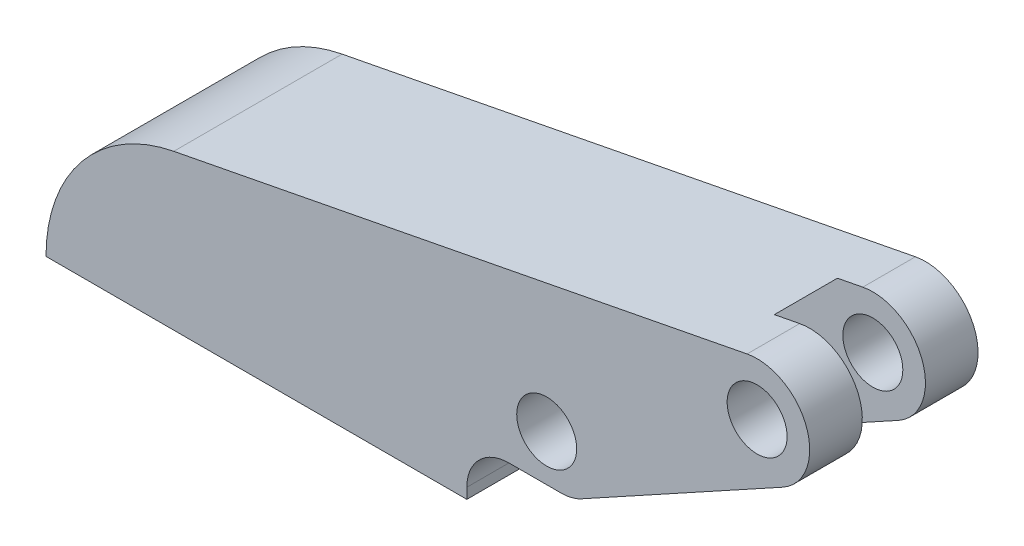
ISO-10303-21;
HEADER;
FILE_DESCRIPTION(('STEP AP214'),'2;1');
FILE_NAME('part.step','',(''),(''),'','','');
FILE_SCHEMA(('AUTOMOTIVE_DESIGN { 1 0 10303 214 1 1 1 1 }'));
ENDSEC;
DATA;
#1=APPLICATION_CONTEXT('core data for automotive mechanical design processes');
#2=APPLICATION_PROTOCOL_DEFINITION('international standard','automotive_design',2000,#1);
#3=PRODUCT_CONTEXT('',#1,'mechanical');
#4=PRODUCT('Part','Part','',(#3));
#5=PRODUCT_RELATED_PRODUCT_CATEGORY('part','',(#4));
#6=PRODUCT_DEFINITION_FORMATION('','',#4);
#7=PRODUCT_DEFINITION_CONTEXT('part definition',#1,'design');
#8=PRODUCT_DEFINITION('design','',#6,#7);
#9=PRODUCT_DEFINITION_SHAPE('','',#8);
#10=(LENGTH_UNIT() NAMED_UNIT(*) SI_UNIT(.MILLI.,.METRE.));
#11=(NAMED_UNIT(*) PLANE_ANGLE_UNIT() SI_UNIT($,.RADIAN.));
#12=(NAMED_UNIT(*) SI_UNIT($,.STERADIAN.) SOLID_ANGLE_UNIT());
#13=UNCERTAINTY_MEASURE_WITH_UNIT(LENGTH_MEASURE(1.E-05),#10,'distance_accuracy_value','');
#14=(GEOMETRIC_REPRESENTATION_CONTEXT(3) GLOBAL_UNCERTAINTY_ASSIGNED_CONTEXT((#13)) GLOBAL_UNIT_ASSIGNED_CONTEXT((#10,
#11,#12)) REPRESENTATION_CONTEXT('',''));
#15=CARTESIAN_POINT('',(0.,0.,0.));
#16=DIRECTION('',(0.,0.,1.));
#17=DIRECTION('',(1.,0.,0.));
#18=AXIS2_PLACEMENT_3D('',#15,#16,#17);
#19=CARTESIAN_POINT('',(45.8343180392922,14.7059179973023,16.));
#20=DIRECTION('',(-0.481918749772156,0.876215908676647,0.));
#21=DIRECTION('',(-0.876215908676647,-0.481918749772156,0.));
#22=AXIS2_PLACEMENT_3D('',#19,#20,#21);
#23=PLANE('',#22);
#24=DIRECTION('',(0.876215908676647,0.481918749772156,0.));
#25=VECTOR('',#24,1.);
#26=CARTESIAN_POINT('',(45.8343180392922,14.7059179973023,4.99999999999999));
#27=LINE('',#26,#25);
#28=CARTESIAN_POINT('',(42.5904062511392,12.9217665138182,5.));
#29=VERTEX_POINT('',#28);
#30=CARTESIAN_POINT('',(64.227719619958,24.8222888666685,4.99999999999999));
#31=VERTEX_POINT('',#30);
#32=EDGE_CURVE('E172',#29,#31,#27,.T.);
#33=ORIENTED_EDGE('',*,*,#32,.T.);
#34=DIRECTION('',(0.,0.,1.));
#35=VECTOR('',#34,1.);
#36=CARTESIAN_POINT('',(64.227719619958,24.8222888666685,16.));
#37=LINE('',#36,#35);
#38=CARTESIAN_POINT('',(64.2277196199582,24.8222888666686,11.));
#39=VERTEX_POINT('',#38);
#40=EDGE_CURVE('E14',#31,#39,#37,.T.);
#41=ORIENTED_EDGE('',*,*,#40,.T.);
#42=DIRECTION('',(0.876215908676647,0.481918749772156,0.));
#43=VECTOR('',#42,1.);
#44=CARTESIAN_POINT('',(86.6879313200957,37.1754053017442,11.));
#45=LINE('',#44,#43);
#46=CARTESIAN_POINT('',(42.5904062511392,12.9217665138182,11.));
#47=VERTEX_POINT('',#46);
#48=EDGE_CURVE('E390',#47,#39,#45,.T.);
#49=ORIENTED_EDGE('',*,*,#48,.F.);
#50=DIRECTION('',(0.,0.,1.));
#51=VECTOR('',#50,1.);
#52=CARTESIAN_POINT('',(42.5904062511392,12.9217665138182,11.));
#53=LINE('',#52,#51);
#54=EDGE_CURVE('E206',#29,#47,#53,.T.);
#55=ORIENTED_EDGE('',*,*,#54,.F.);
#56=EDGE_LOOP('',(#33,#41,#49,#55));
#57=FACE_BOUND('',#56,.T.);
#58=ADVANCED_FACE('F50',(#57),#23,.F.);
#59=CARTESIAN_POINT('',(72.5904062511392,62.8072690634833,11.));
#60=DIRECTION('',(0.,0.,-1.));
#61=DIRECTION('',(-1.,0.,0.));
#62=AXIS2_PLACEMENT_3D('',#59,#60,#61);
#63=PLANE('',#62);
#64=CARTESIAN_POINT('',(47.5904062511392,9.38107954338324,11.));
#65=DIRECTION('',(0.,0.,-1.));
#66=DIRECTION('',(-1.,0.,0.));
#67=AXIS2_PLACEMENT_3D('',#64,#65,#66);
#68=CIRCLE('',#67,2.85);
#69=CARTESIAN_POINT('',(44.7404062511392,9.38107954338324,11.));
#70=VERTEX_POINT('',#69);
#71=EDGE_CURVE('E384',#70,#70,#68,.T.);
#72=ORIENTED_EDGE('',*,*,#71,.F.);
#73=EDGE_LOOP('',(#72));
#74=FACE_BOUND('',#73,.T.);
#75=CARTESIAN_POINT('',(67.5904062511392,20.3810795433832,11.));
#76=DIRECTION('',(0.,0.,-1.));
#77=DIRECTION('',(-1.,0.,0.));
#78=AXIS2_PLACEMENT_3D('',#75,#76,#77);
#79=CIRCLE('',#78,2.85);
#80=CARTESIAN_POINT('',(64.7404062511392,20.3810795433832,11.));
#81=VERTEX_POINT('',#80);
#82=EDGE_CURVE('E205',#81,#81,#79,.T.);
#83=ORIENTED_EDGE('',*,*,#82,.F.);
#84=EDGE_LOOP('',(#83));
#85=FACE_BOUND('',#84,.T.);
#86=DIRECTION('',(-0.981723650130097,-0.190312045796475,0.));
#87=VECTOR('',#86,1.);
#88=CARTESIAN_POINT('',(12.1453193130529,14.7258547519514,11.));
#89=LINE('',#88,#87);
#90=CARTESIAN_POINT('',(66.6388460221569,25.2896977940337,11.));
#91=VERTEX_POINT('',#90);
#92=EDGE_CURVE('E57',#91,#39,#89,.T.);
#93=ORIENTED_EDGE('',*,*,#92,.F.);
#94=CARTESIAN_POINT('',(67.5904062511392,20.3810795433832,11.));
#95=DIRECTION('',(0.,0.,-1.));
#96=DIRECTION('',(-1.,0.,0.));
#97=AXIS2_PLACEMENT_3D('',#94,#95,#96);
#98=CIRCLE('',#97,5.);
#99=CARTESIAN_POINT('',(70.,16.,11.));
#100=VERTEX_POINT('',#99);
#101=EDGE_CURVE('E383',#100,#91,#98,.F.);
#102=ORIENTED_EDGE('',*,*,#101,.F.);
#103=DIRECTION('',(-0.876215908676647,-0.481918749772156,0.));
#104=VECTOR('',#103,1.);
#105=CARTESIAN_POINT('',(50.9002479368971,5.49513636529341,11.));
#106=LINE('',#105,#104);
#107=CARTESIAN_POINT('',(50.9002479368971,5.49513636529341,11.));
#108=VERTEX_POINT('',#107);
#109=EDGE_CURVE('E380',#100,#108,#106,.T.);
#110=ORIENTED_EDGE('',*,*,#109,.T.);
#111=CARTESIAN_POINT('',(48.9725729378085,9.,11.));
#112=DIRECTION('',(0.,0.,-1.));
#113=DIRECTION('',(-1.,0.,0.));
#114=AXIS2_PLACEMENT_3D('',#111,#112,#113);
#115=CIRCLE('',#114,4.);
#116=CARTESIAN_POINT('',(48.9725729378085,5.,11.));
#117=VERTEX_POINT('',#116);
#118=EDGE_CURVE('E375',#117,#108,#115,.F.);
#119=ORIENTED_EDGE('',*,*,#118,.F.);
#120=DIRECTION('',(-1.,0.,0.));
#121=VECTOR('',#120,1.);
#122=CARTESIAN_POINT('',(44.,5.,11.));
#123=LINE('',#122,#121);
#124=CARTESIAN_POINT('',(44.,5.,11.));
#125=VERTEX_POINT('',#124);
#126=EDGE_CURVE('E368',#117,#125,#123,.T.);
#127=ORIENTED_EDGE('',*,*,#126,.T.);
#128=CARTESIAN_POINT('',(44.,1.,11.));
#129=DIRECTION('',(0.,0.,-1.));
#130=DIRECTION('',(-1.,0.,0.));
#131=AXIS2_PLACEMENT_3D('',#128,#129,#130);
#132=CIRCLE('',#131,4.);
#133=CARTESIAN_POINT('',(42.5904062511392,4.74340025420374,11.));
#134=VERTEX_POINT('',#133);
#135=EDGE_CURVE('E314',#125,#134,#132,.F.);
#136=ORIENTED_EDGE('',*,*,#135,.T.);
#137=DIRECTION('',(0.,-1.,0.));
#138=VECTOR('',#137,1.);
#139=CARTESIAN_POINT('',(42.5904062511392,62.8072690634833,11.));
#140=LINE('',#139,#138);
#141=EDGE_CURVE('E189',#47,#134,#140,.T.);
#142=ORIENTED_EDGE('',*,*,#141,.F.);
#143=ORIENTED_EDGE('',*,*,#48,.T.);
#144=EDGE_LOOP('',(#93,#102,#110,#119,#127,#136,#142,#143));
#145=FACE_BOUND('',#144,.T.);
#146=ADVANCED_FACE('F456',(#74,#85,#145),#63,.T.);
#147=CARTESIAN_POINT('',(44.,1.,4.99999999999999));
#148=DIRECTION('',(0.,0.,1.));
#149=DIRECTION('',(1.,0.,0.));
#150=AXIS2_PLACEMENT_3D('',#147,#148,#149);
#151=PLANE('',#150);
#152=CARTESIAN_POINT('',(67.5904062511392,20.3810795433832,4.99999999999999));
#153=DIRECTION('',(0.,0.,-1.));
#154=DIRECTION('',(1.,0.,0.));
#155=AXIS2_PLACEMENT_3D('',#152,#153,#154);
#156=CIRCLE('',#155,2.85000000000001);
#157=CARTESIAN_POINT('',(70.4404062511392,20.3810795433832,4.99999999999999));
#158=VERTEX_POINT('',#157);
#159=EDGE_CURVE('E419',#158,#158,#156,.T.);
#160=ORIENTED_EDGE('',*,*,#159,.T.);
#161=EDGE_LOOP('',(#160));
#162=FACE_BOUND('',#161,.T.);
#163=CARTESIAN_POINT('',(47.5904062511392,9.38107954338324,4.99999999999999));
#164=DIRECTION('',(0.,0.,-1.));
#165=DIRECTION('',(1.,0.,0.));
#166=AXIS2_PLACEMENT_3D('',#163,#164,#165);
#167=CIRCLE('',#166,2.85);
#168=CARTESIAN_POINT('',(50.4404062511392,9.38107954338324,4.99999999999999));
#169=VERTEX_POINT('',#168);
#170=EDGE_CURVE('E407',#169,#169,#167,.T.);
#171=ORIENTED_EDGE('',*,*,#170,.T.);
#172=EDGE_LOOP('',(#171));
#173=FACE_BOUND('',#172,.T.);
#174=CARTESIAN_POINT('',(67.5904062511392,20.3810795433832,4.99999999999999));
#175=DIRECTION('',(0.,0.,-1.));
#176=DIRECTION('',(-1.,0.,0.));
#177=AXIS2_PLACEMENT_3D('',#174,#175,#176);
#178=CIRCLE('',#177,5.);
#179=CARTESIAN_POINT('',(66.6388460221569,25.2896977940337,4.99999999999999));
#180=VERTEX_POINT('',#179);
#181=CARTESIAN_POINT('',(70.,16.,4.99999999999999));
#182=VERTEX_POINT('',#181);
#183=EDGE_CURVE('E414',#180,#182,#178,.T.);
#184=ORIENTED_EDGE('',*,*,#183,.F.);
#185=DIRECTION('',(-0.981723650130097,-0.190312045796475,0.));
#186=VECTOR('',#185,1.);
#187=CARTESIAN_POINT('',(40.281811580834,20.1802546783549,4.99999999999999));
#188=LINE('',#187,#186);
#189=EDGE_CURVE('E191',#180,#31,#188,.T.);
#190=ORIENTED_EDGE('',*,*,#189,.T.);
#191=ORIENTED_EDGE('',*,*,#32,.F.);
#192=DIRECTION('',(0.,1.,0.));
#193=VECTOR('',#192,1.);
#194=CARTESIAN_POINT('',(42.5904062511392,4.74340025420374,5.));
#195=LINE('',#194,#193);
#196=CARTESIAN_POINT('',(42.5904062511392,4.74340025420374,5.));
#197=VERTEX_POINT('',#196);
#198=EDGE_CURVE('E165',#197,#29,#195,.T.);
#199=ORIENTED_EDGE('',*,*,#198,.F.);
#200=CARTESIAN_POINT('',(44.,1.,4.99999999999999));
#201=DIRECTION('',(0.,0.,1.));
#202=DIRECTION('',(1.,0.,0.));
#203=AXIS2_PLACEMENT_3D('',#200,#201,#202);
#204=CIRCLE('',#203,3.99999999999999);
#205=CARTESIAN_POINT('',(44.,5.,5.));
#206=VERTEX_POINT('',#205);
#207=EDGE_CURVE('E169',#206,#197,#204,.T.);
#208=ORIENTED_EDGE('',*,*,#207,.F.);
#209=DIRECTION('',(-1.,0.,0.));
#210=VECTOR('',#209,1.);
#211=CARTESIAN_POINT('',(48.9725729378085,5.,4.99999999999999));
#212=LINE('',#211,#210);
#213=CARTESIAN_POINT('',(48.9725729378085,5.,4.99999999999999));
#214=VERTEX_POINT('',#213);
#215=EDGE_CURVE('E395',#214,#206,#212,.T.);
#216=ORIENTED_EDGE('',*,*,#215,.F.);
#217=CARTESIAN_POINT('',(48.9725729378085,9.,4.99999999999999));
#218=DIRECTION('',(0.,0.,-1.));
#219=DIRECTION('',(-1.,0.,0.));
#220=AXIS2_PLACEMENT_3D('',#217,#218,#219);
#221=CIRCLE('',#220,4.);
#222=CARTESIAN_POINT('',(50.9002479368971,5.49513636529341,5.));
#223=VERTEX_POINT('',#222);
#224=EDGE_CURVE('E409',#223,#214,#221,.T.);
#225=ORIENTED_EDGE('',*,*,#224,.F.);
#226=DIRECTION('',(-0.876215908676647,-0.481918749772156,0.));
#227=VECTOR('',#226,1.);
#228=CARTESIAN_POINT('',(70.,16.,4.99999999999999));
#229=LINE('',#228,#227);
#230=EDGE_CURVE('E412',#182,#223,#229,.T.);
#231=ORIENTED_EDGE('',*,*,#230,.F.);
#232=EDGE_LOOP('',(#184,#190,#191,#199,#208,#216,#225,#231));
#233=FACE_BOUND('',#232,.T.);
#234=ADVANCED_FACE('F167',(#162,#173,#233),#151,.T.);
#235=CARTESIAN_POINT('',(67.5904062511392,20.3810795433832,16.));
#236=DIRECTION('',(0.,0.,-1.));
#237=DIRECTION('',(-1.,0.,0.));
#238=AXIS2_PLACEMENT_3D('',#235,#236,#237);
#239=CYLINDRICAL_SURFACE('',#238,5.);
#240=ORIENTED_EDGE('',*,*,#101,.T.);
#241=DIRECTION('',(0.,0.,-1.));
#242=VECTOR('',#241,1.);
#243=CARTESIAN_POINT('',(66.6388460221569,25.2896977940337,16.));
#244=LINE('',#243,#242);
#245=CARTESIAN_POINT('',(66.6388460221569,25.2896977940337,16.));
#246=VERTEX_POINT('',#245);
#247=EDGE_CURVE('E481',#246,#91,#244,.T.);
#248=ORIENTED_EDGE('',*,*,#247,.F.);
#249=CARTESIAN_POINT('',(67.5904062511392,20.3810795433832,16.));
#250=DIRECTION('',(0.,0.,-1.));
#251=DIRECTION('',(-1.,0.,0.));
#252=AXIS2_PLACEMENT_3D('',#249,#250,#251);
#253=CIRCLE('',#252,5.);
#254=CARTESIAN_POINT('',(70.,16.,16.));
#255=VERTEX_POINT('',#254);
#256=EDGE_CURVE('E285',#246,#255,#253,.T.);
#257=ORIENTED_EDGE('',*,*,#256,.T.);
#258=DIRECTION('',(0.,0.,-1.));
#259=VECTOR('',#258,1.);
#260=CARTESIAN_POINT('',(70.,16.,16.));
#261=LINE('',#260,#259);
#262=EDGE_CURVE('E348',#255,#100,#261,.T.);
#263=ORIENTED_EDGE('',*,*,#262,.T.);
#264=EDGE_LOOP('',(#240,#248,#257,#263));
#265=FACE_BOUND('',#264,.T.);
#266=ADVANCED_FACE('F480',(#265),#239,.T.);
#267=CARTESIAN_POINT('',(44.,1.,16.));
#268=DIRECTION('',(0.,0.,-1.));
#269=DIRECTION('',(-1.,0.,0.));
#270=AXIS2_PLACEMENT_3D('',#267,#268,#269);
#271=CYLINDRICAL_SURFACE('',#270,4.);
#272=CARTESIAN_POINT('',(44.,1.,0.));
#273=DIRECTION('',(0.,0.,-1.));
#274=DIRECTION('',(-1.,0.,0.));
#275=AXIS2_PLACEMENT_3D('',#272,#273,#274);
#276=CIRCLE('',#275,4.);
#277=CARTESIAN_POINT('',(40.,0.999999999999972,0.));
#278=VERTEX_POINT('',#277);
#279=CARTESIAN_POINT('',(44.,5.,0.));
#280=VERTEX_POINT('',#279);
#281=EDGE_CURVE('E258',#278,#280,#276,.T.);
#282=ORIENTED_EDGE('',*,*,#281,.T.);
#283=DIRECTION('',(0.,0.,-1.));
#284=VECTOR('',#283,1.);
#285=CARTESIAN_POINT('',(44.,5.,5.));
#286=LINE('',#285,#284);
#287=EDGE_CURVE('E183',#206,#280,#286,.T.);
#288=ORIENTED_EDGE('',*,*,#287,.F.);
#289=ORIENTED_EDGE('',*,*,#207,.T.);
#290=DIRECTION('',(0.,0.,-1.));
#291=VECTOR('',#290,1.);
#292=CARTESIAN_POINT('',(42.5904062511392,4.74340025420374,16.));
#293=LINE('',#292,#291);
#294=EDGE_CURVE('E181',#134,#197,#293,.T.);
#295=ORIENTED_EDGE('',*,*,#294,.F.);
#296=ORIENTED_EDGE('',*,*,#135,.F.);
#297=DIRECTION('',(0.,0.,-1.));
#298=VECTOR('',#297,1.);
#299=CARTESIAN_POINT('',(44.,5.,16.));
#300=LINE('',#299,#298);
#301=CARTESIAN_POINT('',(44.,5.,16.));
#302=VERTEX_POINT('',#301);
#303=EDGE_CURVE('E235',#302,#125,#300,.T.);
#304=ORIENTED_EDGE('',*,*,#303,.F.);
#305=CARTESIAN_POINT('',(44.,1.,16.));
#306=DIRECTION('',(0.,0.,-1.));
#307=DIRECTION('',(-1.,0.,0.));
#308=AXIS2_PLACEMENT_3D('',#305,#306,#307);
#309=CIRCLE('',#308,4.);
#310=CARTESIAN_POINT('',(40.,0.999999999999972,16.));
#311=VERTEX_POINT('',#310);
#312=EDGE_CURVE('E327',#311,#302,#309,.T.);
#313=ORIENTED_EDGE('',*,*,#312,.F.);
#314=DIRECTION('',(0.,0.,-1.));
#315=VECTOR('',#314,1.);
#316=CARTESIAN_POINT('',(40.,0.999999999999972,16.));
#317=LINE('',#316,#315);
#318=EDGE_CURVE('E230',#311,#278,#317,.T.);
#319=ORIENTED_EDGE('',*,*,#318,.T.);
#320=EDGE_LOOP('',(#282,#288,#289,#295,#296,#304,#313,#319));
#321=FACE_BOUND('',#320,.T.);
#322=ADVANCED_FACE('F179',(#321),#271,.F.);
#323=CARTESIAN_POINT('',(44.,5.,16.));
#324=DIRECTION('',(0.,1.,0.));
#325=DIRECTION('',(-1.,0.,0.));
#326=AXIS2_PLACEMENT_3D('',#323,#324,#325);
#327=PLANE('',#326);
#328=ORIENTED_EDGE('',*,*,#126,.F.);
#329=DIRECTION('',(0.,0.,-1.));
#330=VECTOR('',#329,1.);
#331=CARTESIAN_POINT('',(48.9725729378085,5.,16.));
#332=LINE('',#331,#330);
#333=CARTESIAN_POINT('',(48.9725729378085,5.,16.));
#334=VERTEX_POINT('',#333);
#335=EDGE_CURVE('E347',#334,#117,#332,.T.);
#336=ORIENTED_EDGE('',*,*,#335,.F.);
#337=DIRECTION('',(1.,0.,0.));
#338=VECTOR('',#337,1.);
#339=CARTESIAN_POINT('',(44.,5.,16.));
#340=LINE('',#339,#338);
#341=EDGE_CURVE('E331',#302,#334,#340,.T.);
#342=ORIENTED_EDGE('',*,*,#341,.F.);
#343=ORIENTED_EDGE('',*,*,#303,.T.);
#344=EDGE_LOOP('',(#328,#336,#342,#343));
#345=FACE_BOUND('',#344,.T.);
#346=ADVANCED_FACE('F367',(#345),#327,.F.);
#347=CARTESIAN_POINT('',(48.9725729378085,9.,16.));
#348=DIRECTION('',(0.,0.,-1.));
#349=DIRECTION('',(-1.,0.,0.));
#350=AXIS2_PLACEMENT_3D('',#347,#348,#349);
#351=CYLINDRICAL_SURFACE('',#350,4.);
#352=ORIENTED_EDGE('',*,*,#335,.T.);
#353=ORIENTED_EDGE('',*,*,#118,.T.);
#354=DIRECTION('',(0.,0.,-1.));
#355=VECTOR('',#354,1.);
#356=CARTESIAN_POINT('',(50.9002479368971,5.49513636529341,16.));
#357=LINE('',#356,#355);
#358=CARTESIAN_POINT('',(50.9002479368971,5.49513636529341,16.));
#359=VERTEX_POINT('',#358);
#360=EDGE_CURVE('E343',#359,#108,#357,.T.);
#361=ORIENTED_EDGE('',*,*,#360,.F.);
#362=CARTESIAN_POINT('',(48.9725729378085,9.,16.));
#363=DIRECTION('',(0.,0.,-1.));
#364=DIRECTION('',(-1.,0.,0.));
#365=AXIS2_PLACEMENT_3D('',#362,#363,#364);
#366=CIRCLE('',#365,4.);
#367=EDGE_CURVE('E909',#359,#334,#366,.T.);
#368=ORIENTED_EDGE('',*,*,#367,.T.);
#369=EDGE_LOOP('',(#352,#353,#361,#368));
#370=FACE_BOUND('',#369,.T.);
#371=ADVANCED_FACE('F567',(#370),#351,.T.);
#372=CARTESIAN_POINT('',(50.9002479368971,5.49513636529341,16.));
#373=DIRECTION('',(-0.481918749772156,0.876215908676647,0.));
#374=DIRECTION('',(-0.876215908676647,-0.481918749772156,0.));
#375=AXIS2_PLACEMENT_3D('',#372,#373,#374);
#376=PLANE('',#375);
#377=ORIENTED_EDGE('',*,*,#109,.F.);
#378=ORIENTED_EDGE('',*,*,#262,.F.);
#379=DIRECTION('',(0.876215908676647,0.481918749772156,0.));
#380=VECTOR('',#379,1.);
#381=CARTESIAN_POINT('',(50.9002479368971,5.49513636529341,16.));
#382=LINE('',#381,#380);
#383=EDGE_CURVE('E292',#359,#255,#382,.T.);
#384=ORIENTED_EDGE('',*,*,#383,.F.);
#385=ORIENTED_EDGE('',*,*,#360,.T.);
#386=EDGE_LOOP('',(#377,#378,#384,#385));
#387=FACE_BOUND('',#386,.T.);
#388=ADVANCED_FACE('F579',(#387),#376,.F.);
#389=CARTESIAN_POINT('',(66.6388460221569,25.2896977940337,0.));
#390=VERTEX_POINT('',#389);
#391=EDGE_CURVE('E488',#180,#390,#244,.T.);
#392=ORIENTED_EDGE('',*,*,#391,.F.);
#393=ORIENTED_EDGE('',*,*,#183,.T.);
#394=DIRECTION('',(0.,0.,-1.));
#395=VECTOR('',#394,1.);
#396=CARTESIAN_POINT('',(70.,16.,4.99999999999999));
#397=LINE('',#396,#395);
#398=CARTESIAN_POINT('',(70.,16.,0.));
#399=VERTEX_POINT('',#398);
#400=EDGE_CURVE('E391',#182,#399,#397,.T.);
#401=ORIENTED_EDGE('',*,*,#400,.T.);
#402=CARTESIAN_POINT('',(67.5904062511392,20.3810795433832,0.));
#403=DIRECTION('',(0.,0.,-1.));
#404=DIRECTION('',(-1.,0.,0.));
#405=AXIS2_PLACEMENT_3D('',#402,#403,#404);
#406=CIRCLE('',#405,5.);
#407=EDGE_CURVE('E265',#390,#399,#406,.T.);
#408=ORIENTED_EDGE('',*,*,#407,.F.);
#409=EDGE_LOOP('',(#392,#393,#401,#408));
#410=FACE_BOUND('',#409,.T.);
#411=ADVANCED_FACE('F591',(#410),#239,.T.);
#412=CARTESIAN_POINT('',(47.5904062511392,9.38107954338324,16.));
#413=DIRECTION('',(0.,0.,-1.));
#414=DIRECTION('',(-1.,0.,0.));
#415=AXIS2_PLACEMENT_3D('',#412,#413,#414);
#416=CYLINDRICAL_SURFACE('',#415,2.85);
#417=CARTESIAN_POINT('',(47.5904062511392,9.38107954338324,16.));
#418=DIRECTION('',(0.,0.,1.));
#419=DIRECTION('',(1.,0.,0.));
#420=AXIS2_PLACEMENT_3D('',#417,#418,#419);
#421=CIRCLE('',#420,2.85);
#422=CARTESIAN_POINT('',(50.4404062511392,9.38107954338324,16.));
#423=VERTEX_POINT('',#422);
#424=EDGE_CURVE('E299',#423,#423,#421,.T.);
#425=ORIENTED_EDGE('',*,*,#424,.T.);
#426=EDGE_LOOP('',(#425));
#427=FACE_BOUND('',#426,.T.);
#428=ORIENTED_EDGE('',*,*,#71,.T.);
#429=EDGE_LOOP('',(#428));
#430=FACE_BOUND('',#429,.T.);
#431=ADVANCED_FACE('F604',(#427,#430),#416,.F.);
#432=CARTESIAN_POINT('',(67.5904062511392,20.3810795433832,16.));
#433=DIRECTION('',(0.,0.,-1.));
#434=DIRECTION('',(-1.,0.,0.));
#435=AXIS2_PLACEMENT_3D('',#432,#433,#434);
#436=CYLINDRICAL_SURFACE('',#435,2.85);
#437=CARTESIAN_POINT('',(67.5904062511392,20.3810795433832,16.));
#438=DIRECTION('',(0.,0.,1.));
#439=DIRECTION('',(1.,0.,0.));
#440=AXIS2_PLACEMENT_3D('',#437,#438,#439);
#441=CIRCLE('',#440,2.85);
#442=CARTESIAN_POINT('',(70.4404062511392,20.3810795433832,16.));
#443=VERTEX_POINT('',#442);
#444=EDGE_CURVE('E306',#443,#443,#441,.T.);
#445=ORIENTED_EDGE('',*,*,#444,.T.);
#446=EDGE_LOOP('',(#445));
#447=FACE_BOUND('',#446,.T.);
#448=ORIENTED_EDGE('',*,*,#82,.T.);
#449=EDGE_LOOP('',(#448));
#450=FACE_BOUND('',#449,.T.);
#451=ADVANCED_FACE('F617',(#447,#450),#436,.F.);
#452=CARTESIAN_POINT('',(15.,0.,16.));
#453=DIRECTION('',(0.,0.,1.));
#454=DIRECTION('',(1.,0.,0.));
#455=AXIS2_PLACEMENT_3D('',#452,#453,#454);
#456=PLANE('',#455);
#457=ORIENTED_EDGE('',*,*,#424,.F.);
#458=EDGE_LOOP('',(#457));
#459=FACE_BOUND('',#458,.T.);
#460=CARTESIAN_POINT('',(15.,0.,16.));
#461=DIRECTION('',(0.,0.,1.));
#462=DIRECTION('',(1.,0.,0.));
#463=AXIS2_PLACEMENT_3D('',#460,#461,#462);
#464=CIRCLE('',#463,15.);
#465=CARTESIAN_POINT('',(12.1453193130529,14.7258547519514,16.));
#466=VERTEX_POINT('',#465);
#467=CARTESIAN_POINT('',(0.,0.,16.));
#468=VERTEX_POINT('',#467);
#469=EDGE_CURVE('E318',#466,#468,#464,.T.);
#470=ORIENTED_EDGE('',*,*,#469,.T.);
#471=DIRECTION('',(1.,0.,0.));
#472=VECTOR('',#471,1.);
#473=CARTESIAN_POINT('',(0.,0.,16.));
#474=LINE('',#473,#472);
#475=CARTESIAN_POINT('',(40.,0.,16.));
#476=VERTEX_POINT('',#475);
#477=EDGE_CURVE('E322',#468,#476,#474,.T.);
#478=ORIENTED_EDGE('',*,*,#477,.T.);
#479=DIRECTION('',(0.,1.,0.));
#480=VECTOR('',#479,1.);
#481=CARTESIAN_POINT('',(40.,0.,16.));
#482=LINE('',#481,#480);
#483=EDGE_CURVE('E249',#476,#311,#482,.T.);
#484=ORIENTED_EDGE('',*,*,#483,.T.);
#485=ORIENTED_EDGE('',*,*,#312,.T.);
#486=ORIENTED_EDGE('',*,*,#341,.T.);
#487=ORIENTED_EDGE('',*,*,#367,.F.);
#488=ORIENTED_EDGE('',*,*,#383,.T.);
#489=ORIENTED_EDGE('',*,*,#256,.F.);
#490=DIRECTION('',(0.981723650130097,0.190312045796475,0.));
#491=VECTOR('',#490,1.);
#492=CARTESIAN_POINT('',(12.1453193130529,14.7258547519514,16.));
#493=LINE('',#492,#491);
#494=EDGE_CURVE('E291',#466,#246,#493,.T.);
#495=ORIENTED_EDGE('',*,*,#494,.F.);
#496=EDGE_LOOP('',(#470,#478,#484,#485,#486,#487,#488,#489,#495));
#497=FACE_BOUND('',#496,.T.);
#498=ORIENTED_EDGE('',*,*,#444,.F.);
#499=EDGE_LOOP('',(#498));
#500=FACE_BOUND('',#499,.T.);
#501=ADVANCED_FACE('F439',(#459,#497,#500),#456,.T.);
#502=CARTESIAN_POINT('',(15.,0.,0.));
#503=DIRECTION('',(0.,0.,1.));
#504=DIRECTION('',(1.,0.,0.));
#505=AXIS2_PLACEMENT_3D('',#502,#503,#504);
#506=PLANE('',#505);
#507=DIRECTION('',(-1.,0.,0.));
#508=VECTOR('',#507,1.);
#509=CARTESIAN_POINT('',(48.9725729378085,5.,0.));
#510=LINE('',#509,#508);
#511=CARTESIAN_POINT('',(48.9725729378085,5.,0.));
#512=VERTEX_POINT('',#511);
#513=EDGE_CURVE('E184',#512,#280,#510,.T.);
#514=ORIENTED_EDGE('',*,*,#513,.T.);
#515=ORIENTED_EDGE('',*,*,#281,.F.);
#516=DIRECTION('',(0.,1.,0.));
#517=VECTOR('',#516,1.);
#518=CARTESIAN_POINT('',(40.,0.,0.));
#519=LINE('',#518,#517);
#520=CARTESIAN_POINT('',(40.,0.,0.));
#521=VERTEX_POINT('',#520);
#522=EDGE_CURVE('E248',#521,#278,#519,.T.);
#523=ORIENTED_EDGE('',*,*,#522,.F.);
#524=DIRECTION('',(1.,0.,0.));
#525=VECTOR('',#524,1.);
#526=CARTESIAN_POINT('',(0.,0.,0.));
#527=LINE('',#526,#525);
#528=CARTESIAN_POINT('',(0.,0.,0.));
#529=VERTEX_POINT('',#528);
#530=EDGE_CURVE('E257',#529,#521,#527,.T.);
#531=ORIENTED_EDGE('',*,*,#530,.F.);
#532=CARTESIAN_POINT('',(15.,0.,0.));
#533=DIRECTION('',(0.,0.,1.));
#534=DIRECTION('',(1.,0.,0.));
#535=AXIS2_PLACEMENT_3D('',#532,#533,#534);
#536=CIRCLE('',#535,15.);
#537=CARTESIAN_POINT('',(12.1453193130529,14.7258547519514,0.));
#538=VERTEX_POINT('',#537);
#539=EDGE_CURVE('E267',#538,#529,#536,.T.);
#540=ORIENTED_EDGE('',*,*,#539,.F.);
#541=DIRECTION('',(0.981723650130097,0.190312045796475,0.));
#542=VECTOR('',#541,1.);
#543=CARTESIAN_POINT('',(12.1453193130529,14.7258547519514,0.));
#544=LINE('',#543,#542);
#545=EDGE_CURVE('E274',#538,#390,#544,.T.);
#546=ORIENTED_EDGE('',*,*,#545,.T.);
#547=ORIENTED_EDGE('',*,*,#407,.T.);
#548=DIRECTION('',(-0.876215908676647,-0.481918749772156,0.));
#549=VECTOR('',#548,1.);
#550=CARTESIAN_POINT('',(70.,16.,0.));
#551=LINE('',#550,#549);
#552=CARTESIAN_POINT('',(50.9002479368971,5.49513636529341,0.));
#553=VERTEX_POINT('',#552);
#554=EDGE_CURVE('E404',#399,#553,#551,.T.);
#555=ORIENTED_EDGE('',*,*,#554,.T.);
#556=CARTESIAN_POINT('',(48.9725729378085,9.,0.));
#557=DIRECTION('',(0.,0.,-1.));
#558=DIRECTION('',(-1.,0.,0.));
#559=AXIS2_PLACEMENT_3D('',#556,#557,#558);
#560=CIRCLE('',#559,4.);
#561=EDGE_CURVE('E401',#553,#512,#560,.T.);
#562=ORIENTED_EDGE('',*,*,#561,.T.);
#563=EDGE_LOOP('',(#514,#515,#523,#531,#540,#546,#547,#555,#562));
#564=FACE_BOUND('',#563,.T.);
#565=CARTESIAN_POINT('',(67.5904062511392,20.3810795433832,0.));
#566=DIRECTION('',(0.,0.,-1.));
#567=DIRECTION('',(1.,0.,0.));
#568=AXIS2_PLACEMENT_3D('',#565,#566,#567);
#569=CIRCLE('',#568,2.85000000000001);
#570=CARTESIAN_POINT('',(70.4404062511392,20.3810795433832,0.));
#571=VERTEX_POINT('',#570);
#572=EDGE_CURVE('E422',#571,#571,#569,.T.);
#573=ORIENTED_EDGE('',*,*,#572,.F.);
#574=EDGE_LOOP('',(#573));
#575=FACE_BOUND('',#574,.T.);
#576=CARTESIAN_POINT('',(47.5904062511392,9.38107954338324,0.));
#577=DIRECTION('',(0.,0.,-1.));
#578=DIRECTION('',(1.,0.,0.));
#579=AXIS2_PLACEMENT_3D('',#576,#577,#578);
#580=CIRCLE('',#579,2.85);
#581=CARTESIAN_POINT('',(50.4404062511392,9.38107954338324,0.));
#582=VERTEX_POINT('',#581);
#583=EDGE_CURVE('E416',#582,#582,#580,.T.);
#584=ORIENTED_EDGE('',*,*,#583,.F.);
#585=EDGE_LOOP('',(#584));
#586=FACE_BOUND('',#585,.T.);
#587=ADVANCED_FACE('F254',(#564,#575,#586),#506,.F.);
#588=CARTESIAN_POINT('',(15.,0.,16.));
#589=DIRECTION('',(0.,0.,-1.));
#590=DIRECTION('',(-1.,0.,0.));
#591=AXIS2_PLACEMENT_3D('',#588,#589,#590);
#592=CYLINDRICAL_SURFACE('',#591,15.);
#593=ORIENTED_EDGE('',*,*,#539,.T.);
#594=DIRECTION('',(0.,0.,-1.));
#595=VECTOR('',#594,1.);
#596=CARTESIAN_POINT('',(0.,0.,16.));
#597=LINE('',#596,#595);
#598=EDGE_CURVE('E192',#468,#529,#597,.T.);
#599=ORIENTED_EDGE('',*,*,#598,.F.);
#600=ORIENTED_EDGE('',*,*,#469,.F.);
#601=DIRECTION('',(0.,0.,-1.));
#602=VECTOR('',#601,1.);
#603=CARTESIAN_POINT('',(12.1453193130529,14.7258547519514,16.));
#604=LINE('',#603,#602);
#605=EDGE_CURVE('E296',#466,#538,#604,.T.);
#606=ORIENTED_EDGE('',*,*,#605,.T.);
#607=EDGE_LOOP('',(#593,#599,#600,#606));
#608=FACE_BOUND('',#607,.T.);
#609=ADVANCED_FACE('F438',(#608),#592,.T.);
#610=CARTESIAN_POINT('',(0.,0.,16.));
#611=DIRECTION('',(0.,1.,0.));
#612=DIRECTION('',(0.,0.,1.));
#613=AXIS2_PLACEMENT_3D('',#610,#611,#612);
#614=PLANE('',#613);
#615=ORIENTED_EDGE('',*,*,#530,.T.);
#616=DIRECTION('',(0.,0.,-1.));
#617=VECTOR('',#616,1.);
#618=CARTESIAN_POINT('',(40.,0.,16.));
#619=LINE('',#618,#617);
#620=EDGE_CURVE('E200',#476,#521,#619,.T.);
#621=ORIENTED_EDGE('',*,*,#620,.F.);
#622=ORIENTED_EDGE('',*,*,#477,.F.);
#623=ORIENTED_EDGE('',*,*,#598,.T.);
#624=EDGE_LOOP('',(#615,#621,#622,#623));
#625=FACE_BOUND('',#624,.T.);
#626=ADVANCED_FACE('F662',(#625),#614,.F.);
#627=CARTESIAN_POINT('',(40.,0.,16.));
#628=DIRECTION('',(-1.,0.,0.));
#629=DIRECTION('',(0.,0.,1.));
#630=AXIS2_PLACEMENT_3D('',#627,#628,#629);
#631=PLANE('',#630);
#632=ORIENTED_EDGE('',*,*,#522,.T.);
#633=ORIENTED_EDGE('',*,*,#318,.F.);
#634=ORIENTED_EDGE('',*,*,#483,.F.);
#635=ORIENTED_EDGE('',*,*,#620,.T.);
#636=EDGE_LOOP('',(#632,#633,#634,#635));
#637=FACE_BOUND('',#636,.T.);
#638=ADVANCED_FACE('F246',(#637),#631,.F.);
#639=CARTESIAN_POINT('',(12.1453193130529,14.7258547519514,16.));
#640=DIRECTION('',(-0.190312045796475,0.981723650130097,0.));
#641=DIRECTION('',(-0.981723650130097,-0.190312045796475,0.));
#642=AXIS2_PLACEMENT_3D('',#639,#640,#641);
#643=PLANE('',#642);
#644=ORIENTED_EDGE('',*,*,#40,.F.);
#645=ORIENTED_EDGE('',*,*,#189,.F.);
#646=ORIENTED_EDGE('',*,*,#391,.T.);
#647=ORIENTED_EDGE('',*,*,#545,.F.);
#648=ORIENTED_EDGE('',*,*,#605,.F.);
#649=ORIENTED_EDGE('',*,*,#494,.T.);
#650=ORIENTED_EDGE('',*,*,#247,.T.);
#651=ORIENTED_EDGE('',*,*,#92,.T.);
#652=EDGE_LOOP('',(#644,#645,#646,#647,#648,#649,#650,#651));
#653=FACE_BOUND('',#652,.T.);
#654=ADVANCED_FACE('F485',(#653),#643,.T.);
#655=CARTESIAN_POINT('',(42.5904062511392,62.8072690634833,11.));
#656=DIRECTION('',(1.,0.,0.));
#657=DIRECTION('',(0.,0.,-1.));
#658=AXIS2_PLACEMENT_3D('',#655,#656,#657);
#659=PLANE('',#658);
#660=ORIENTED_EDGE('',*,*,#198,.T.);
#661=ORIENTED_EDGE('',*,*,#54,.T.);
#662=ORIENTED_EDGE('',*,*,#141,.T.);
#663=ORIENTED_EDGE('',*,*,#294,.T.);
#664=EDGE_LOOP('',(#660,#661,#662,#663));
#665=FACE_BOUND('',#664,.T.);
#666=ADVANCED_FACE('F187',(#665),#659,.T.);
#667=CARTESIAN_POINT('',(48.9725729378085,5.,4.99999999999999));
#668=DIRECTION('',(0.,-1.,0.));
#669=DIRECTION('',(0.,0.,-1.));
#670=AXIS2_PLACEMENT_3D('',#667,#668,#669);
#671=PLANE('',#670);
#672=ORIENTED_EDGE('',*,*,#513,.F.);
#673=DIRECTION('',(0.,0.,-1.));
#674=VECTOR('',#673,1.);
#675=CARTESIAN_POINT('',(48.9725729378085,5.,4.99999999999999));
#676=LINE('',#675,#674);
#677=EDGE_CURVE('E397',#214,#512,#676,.T.);
#678=ORIENTED_EDGE('',*,*,#677,.F.);
#679=ORIENTED_EDGE('',*,*,#215,.T.);
#680=ORIENTED_EDGE('',*,*,#287,.T.);
#681=EDGE_LOOP('',(#672,#678,#679,#680));
#682=FACE_BOUND('',#681,.T.);
#683=ADVANCED_FACE('F704',(#682),#671,.T.);
#684=CARTESIAN_POINT('',(48.9725729378085,9.,4.99999999999999));
#685=DIRECTION('',(0.,0.,-1.));
#686=DIRECTION('',(-1.,0.,0.));
#687=AXIS2_PLACEMENT_3D('',#684,#685,#686);
#688=CYLINDRICAL_SURFACE('',#687,4.);
#689=ORIENTED_EDGE('',*,*,#561,.F.);
#690=DIRECTION('',(0.,0.,-1.));
#691=VECTOR('',#690,1.);
#692=CARTESIAN_POINT('',(50.9002479368971,5.49513636529341,5.));
#693=LINE('',#692,#691);
#694=EDGE_CURVE('E394',#223,#553,#693,.T.);
#695=ORIENTED_EDGE('',*,*,#694,.F.);
#696=ORIENTED_EDGE('',*,*,#224,.T.);
#697=ORIENTED_EDGE('',*,*,#677,.T.);
#698=EDGE_LOOP('',(#689,#695,#696,#697));
#699=FACE_BOUND('',#698,.T.);
#700=ADVANCED_FACE('F450',(#699),#688,.T.);
#701=CARTESIAN_POINT('',(70.,16.,4.99999999999999));
#702=DIRECTION('',(0.481918749772156,-0.876215908676647,0.));
#703=DIRECTION('',(0.876215908676647,0.481918749772156,0.));
#704=AXIS2_PLACEMENT_3D('',#701,#702,#703);
#705=PLANE('',#704);
#706=ORIENTED_EDGE('',*,*,#554,.F.);
#707=ORIENTED_EDGE('',*,*,#400,.F.);
#708=ORIENTED_EDGE('',*,*,#230,.T.);
#709=ORIENTED_EDGE('',*,*,#694,.T.);
#710=EDGE_LOOP('',(#706,#707,#708,#709));
#711=FACE_BOUND('',#710,.T.);
#712=ADVANCED_FACE('F444',(#711),#705,.T.);
#713=CARTESIAN_POINT('',(47.5904062511392,9.38107954338324,4.99999999999999));
#714=DIRECTION('',(0.,0.,-1.));
#715=DIRECTION('',(-1.,0.,0.));
#716=AXIS2_PLACEMENT_3D('',#713,#714,#715);
#717=CYLINDRICAL_SURFACE('',#716,2.85);
#718=ORIENTED_EDGE('',*,*,#170,.F.);
#719=EDGE_LOOP('',(#718));
#720=FACE_BOUND('',#719,.T.);
#721=ORIENTED_EDGE('',*,*,#583,.T.);
#722=EDGE_LOOP('',(#721));
#723=FACE_BOUND('',#722,.T.);
#724=ADVANCED_FACE('F433',(#720,#723),#717,.F.);
#725=CARTESIAN_POINT('',(67.5904062511392,20.3810795433832,4.99999999999999));
#726=DIRECTION('',(0.,0.,-1.));
#727=DIRECTION('',(-1.,0.,0.));
#728=AXIS2_PLACEMENT_3D('',#725,#726,#727);
#729=CYLINDRICAL_SURFACE('',#728,2.85000000000001);
#730=ORIENTED_EDGE('',*,*,#159,.F.);
#731=EDGE_LOOP('',(#730));
#732=FACE_BOUND('',#731,.T.);
#733=ORIENTED_EDGE('',*,*,#572,.T.);
#734=EDGE_LOOP('',(#733));
#735=FACE_BOUND('',#734,.T.);
#736=ADVANCED_FACE('F430',(#732,#735),#729,.F.);
#737=CLOSED_SHELL('',(#58,#146,#234,#266,#322,#346,#371,#388,#411,#431,#451,#501,#587,#609,#626,
#638,#654,#666,#683,#700,#712,#724,#736));
#738=MANIFOLD_SOLID_BREP('B2',#737);
#739=ADVANCED_BREP_SHAPE_REPRESENTATION('',(#18,#738),#14);
#740=SHAPE_DEFINITION_REPRESENTATION(#9,#739);
ENDSEC;
END-ISO-10303-21;
